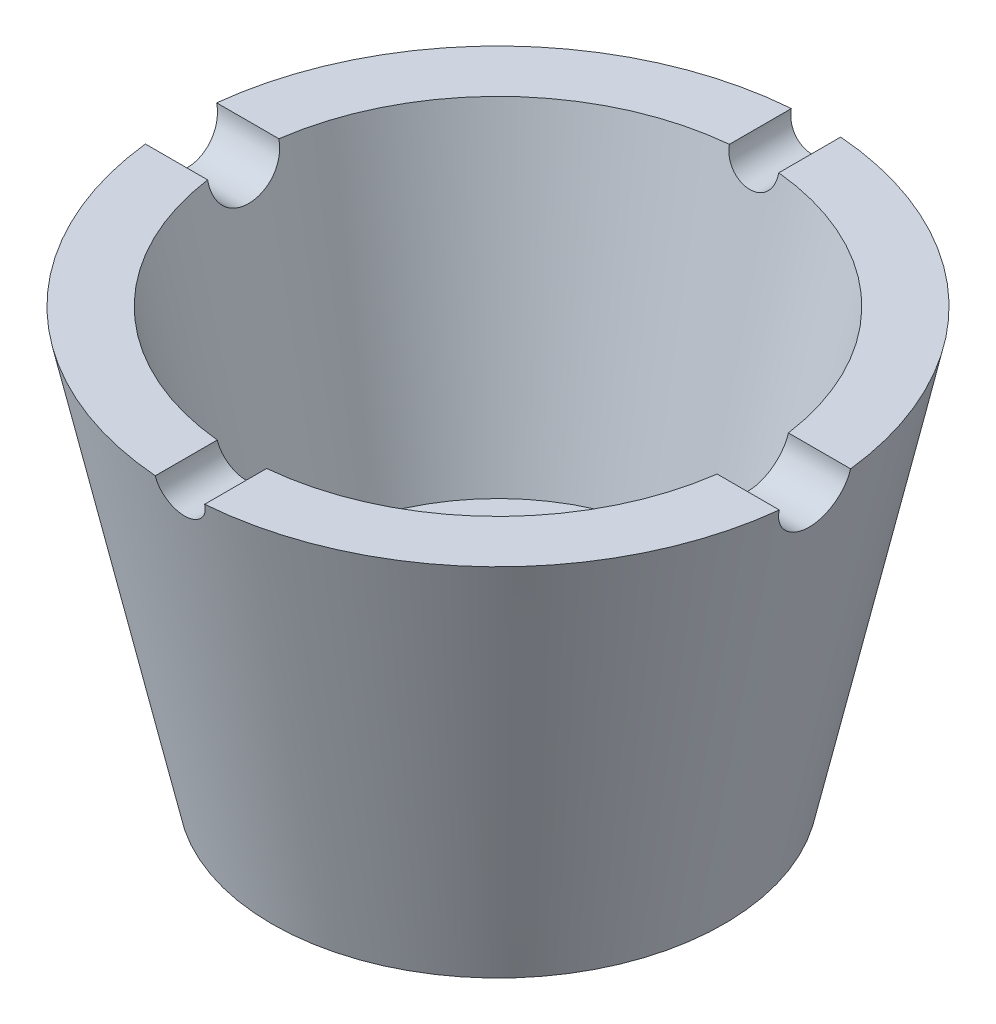
ISO-10303-21;
HEADER;
FILE_DESCRIPTION(('STEP AP214'),'2;1');
FILE_NAME('part.step','',(''),(''),'','','');
FILE_SCHEMA(('AUTOMOTIVE_DESIGN { 1 0 10303 214 1 1 1 1 }'));
ENDSEC;
DATA;
#1=APPLICATION_CONTEXT('core data for automotive mechanical design processes');
#2=APPLICATION_PROTOCOL_DEFINITION('international standard','automotive_design',2000,#1);
#3=PRODUCT_CONTEXT('',#1,'mechanical');
#4=PRODUCT('Part','Part','',(#3));
#5=PRODUCT_RELATED_PRODUCT_CATEGORY('part','',(#4));
#6=PRODUCT_DEFINITION_FORMATION('','',#4);
#7=PRODUCT_DEFINITION_CONTEXT('part definition',#1,'design');
#8=PRODUCT_DEFINITION('design','',#6,#7);
#9=PRODUCT_DEFINITION_SHAPE('','',#8);
#10=(LENGTH_UNIT() NAMED_UNIT(*) SI_UNIT(.MILLI.,.METRE.));
#11=(NAMED_UNIT(*) PLANE_ANGLE_UNIT() SI_UNIT($,.RADIAN.));
#12=(NAMED_UNIT(*) SI_UNIT($,.STERADIAN.) SOLID_ANGLE_UNIT());
#13=UNCERTAINTY_MEASURE_WITH_UNIT(LENGTH_MEASURE(1.E-05),#10,'distance_accuracy_value','');
#14=(GEOMETRIC_REPRESENTATION_CONTEXT(3) GLOBAL_UNCERTAINTY_ASSIGNED_CONTEXT((#13)) GLOBAL_UNIT_ASSIGNED_CONTEXT((#10,
#11,#12)) REPRESENTATION_CONTEXT('',''));
#15=CARTESIAN_POINT('',(0.,0.,0.));
#16=DIRECTION('',(0.,0.,1.));
#17=DIRECTION('',(1.,0.,0.));
#18=AXIS2_PLACEMENT_3D('',#15,#16,#17);
#19=CARTESIAN_POINT('',(31.7536642327049,40.8299646596772,0.));
#20=DIRECTION('',(0.,-1.,0.));
#21=DIRECTION('',(0.,0.,-1.));
#22=AXIS2_PLACEMENT_3D('',#19,#20,#21);
#23=PLANE('',#22);
#24=CARTESIAN_POINT('',(0.,40.8299646596772,0.));
#25=DIRECTION('',(0.,1.,0.));
#26=DIRECTION('',(0.,0.,1.));
#27=AXIS2_PLACEMENT_3D('',#24,#25,#26);
#28=CIRCLE('',#27,31.7536642327049);
#29=CARTESIAN_POINT('',(31.5548418955382,40.8299646596772,-3.54783668605957));
#30=VERTEX_POINT('',#29);
#31=CARTESIAN_POINT('',(2.45697094488806,40.8299646596772,-31.6584662606914));
#32=VERTEX_POINT('',#31);
#33=EDGE_CURVE('E117',#30,#32,#28,.T.);
#34=ORIENTED_EDGE('',*,*,#33,.T.);
#35=DIRECTION('',(0.,0.,1.));
#36=VECTOR('',#35,1.);
#37=CARTESIAN_POINT('',(2.45697094488806,40.8299646596772,-50.));
#38=LINE('',#37,#36);
#39=CARTESIAN_POINT('',(2.45697094488806,40.8299646596772,-25.4916282247166));
#40=VERTEX_POINT('',#39);
#41=EDGE_CURVE('E100',#32,#40,#38,.T.);
#42=ORIENTED_EDGE('',*,*,#41,.T.);
#43=CARTESIAN_POINT('',(0.,40.8299646596772,0.));
#44=DIRECTION('',(0.,1.,0.));
#45=DIRECTION('',(0.,0.,1.));
#46=AXIS2_PLACEMENT_3D('',#43,#44,#45);
#47=CIRCLE('',#46,25.6097601662178);
#48=CARTESIAN_POINT('',(25.3628206361249,40.8299646596772,-3.54783668605957));
#49=VERTEX_POINT('',#48);
#50=EDGE_CURVE('E133',#49,#40,#47,.T.);
#51=ORIENTED_EDGE('',*,*,#50,.F.);
#52=DIRECTION('',(1.,0.,0.));
#53=VECTOR('',#52,1.);
#54=CARTESIAN_POINT('',(-50.,40.8299646596772,-3.54783668605957));
#55=LINE('',#54,#53);
#56=EDGE_CURVE('E123',#49,#30,#55,.T.);
#57=ORIENTED_EDGE('',*,*,#56,.T.);
#58=EDGE_LOOP('',(#34,#42,#51,#57));
#59=FACE_BOUND('',#58,.T.);
#60=ADVANCED_FACE('F33',(#59),#23,.F.);
#61=CARTESIAN_POINT('',(2.45697094488806,40.8299646596772,25.4916282247166));
#62=VERTEX_POINT('',#61);
#63=CARTESIAN_POINT('',(25.3628206361249,40.8299646596772,3.54783668605957));
#64=VERTEX_POINT('',#63);
#65=EDGE_CURVE('E139',#62,#64,#47,.T.);
#66=ORIENTED_EDGE('',*,*,#65,.F.);
#67=CARTESIAN_POINT('',(2.45697094488806,40.8299646596772,31.6584662606914));
#68=VERTEX_POINT('',#67);
#69=EDGE_CURVE('E61',#62,#68,#38,.T.);
#70=ORIENTED_EDGE('',*,*,#69,.T.);
#71=CARTESIAN_POINT('',(31.5548418955382,40.8299646596772,3.54783668605957));
#72=VERTEX_POINT('',#71);
#73=EDGE_CURVE('E127',#68,#72,#28,.T.);
#74=ORIENTED_EDGE('',*,*,#73,.T.);
#75=DIRECTION('',(1.,0.,0.));
#76=VECTOR('',#75,1.);
#77=CARTESIAN_POINT('',(-50.,40.8299646596772,3.54783668605957));
#78=LINE('',#77,#76);
#79=EDGE_CURVE('E201',#64,#72,#78,.T.);
#80=ORIENTED_EDGE('',*,*,#79,.F.);
#81=EDGE_LOOP('',(#66,#70,#74,#80));
#82=FACE_BOUND('',#81,.T.);
#83=ADVANCED_FACE('F225',(#82),#23,.F.);
#84=CARTESIAN_POINT('',(-2.45697094488806,40.8299646596772,-25.4916282247166));
#85=VERTEX_POINT('',#84);
#86=CARTESIAN_POINT('',(-25.3628206361249,40.8299646596772,-3.54783668605957));
#87=VERTEX_POINT('',#86);
#88=EDGE_CURVE('E137',#85,#87,#47,.T.);
#89=ORIENTED_EDGE('',*,*,#88,.F.);
#90=DIRECTION('',(0.,0.,1.));
#91=VECTOR('',#90,1.);
#92=CARTESIAN_POINT('',(-2.45697094488806,40.8299646596772,-50.));
#93=LINE('',#92,#91);
#94=CARTESIAN_POINT('',(-2.45697094488806,40.8299646596772,-31.6584662606914));
#95=VERTEX_POINT('',#94);
#96=EDGE_CURVE('E53',#95,#85,#93,.T.);
#97=ORIENTED_EDGE('',*,*,#96,.F.);
#98=CARTESIAN_POINT('',(-31.5548418955382,40.8299646596772,-3.54783668605957));
#99=VERTEX_POINT('',#98);
#100=EDGE_CURVE('E119',#95,#99,#28,.T.);
#101=ORIENTED_EDGE('',*,*,#100,.T.);
#102=EDGE_CURVE('E199',#99,#87,#55,.T.);
#103=ORIENTED_EDGE('',*,*,#102,.T.);
#104=EDGE_LOOP('',(#89,#97,#101,#103));
#105=FACE_BOUND('',#104,.T.);
#106=ADVANCED_FACE('F197',(#105),#23,.F.);
#107=CARTESIAN_POINT('',(19.,10.8299646596772,0.));
#108=DIRECTION('',(0.,-1.,0.));
#109=DIRECTION('',(0.,0.,-1.));
#110=AXIS2_PLACEMENT_3D('',#107,#108,#109);
#111=PLANE('',#110);
#112=CARTESIAN_POINT('',(0.,10.8299646596772,0.));
#113=DIRECTION('',(0.,1.,0.));
#114=DIRECTION('',(0.,0.,1.));
#115=AXIS2_PLACEMENT_3D('',#112,#113,#114);
#116=CIRCLE('',#115,11.25);
#117=CARTESIAN_POINT('',(0.,10.8299646596772,11.25));
#118=VERTEX_POINT('',#117);
#119=EDGE_CURVE('E246',#118,#118,#116,.T.);
#120=ORIENTED_EDGE('',*,*,#119,.F.);
#121=EDGE_LOOP('',(#120));
#122=FACE_BOUND('',#121,.T.);
#123=CARTESIAN_POINT('',(0.,10.8299646596772,0.));
#124=DIRECTION('',(0.,1.,0.));
#125=DIRECTION('',(0.,0.,1.));
#126=AXIS2_PLACEMENT_3D('',#123,#124,#125);
#127=CIRCLE('',#126,19.);
#128=CARTESIAN_POINT('',(0.,10.8299646596772,19.));
#129=VERTEX_POINT('',#128);
#130=EDGE_CURVE('E144',#129,#129,#127,.T.);
#131=ORIENTED_EDGE('',*,*,#130,.T.);
#132=EDGE_LOOP('',(#131));
#133=FACE_BOUND('',#132,.T.);
#134=ADVANCED_FACE('F35',(#122,#133),#111,.F.);
#135=CARTESIAN_POINT('',(0.,29.136855034283,0.));
#136=DIRECTION('',(0.,1.,0.));
#137=DIRECTION('',(0.,0.,1.));
#138=AXIS2_PLACEMENT_3D('',#135,#136,#137);
#139=CYLINDRICAL_SURFACE('',#138,11.25);
#140=CARTESIAN_POINT('',(0.,-1.17003534032281,0.));
#141=DIRECTION('',(0.,1.,0.));
#142=DIRECTION('',(0.,0.,1.));
#143=AXIS2_PLACEMENT_3D('',#140,#141,#142);
#144=CIRCLE('',#143,11.25);
#145=CARTESIAN_POINT('',(0.,-1.17003534032281,11.25));
#146=VERTEX_POINT('',#145);
#147=EDGE_CURVE('E129',#146,#146,#144,.T.);
#148=ORIENTED_EDGE('',*,*,#147,.F.);
#149=EDGE_LOOP('',(#148));
#150=FACE_BOUND('',#149,.T.);
#151=ORIENTED_EDGE('',*,*,#119,.T.);
#152=EDGE_LOOP('',(#151));
#153=FACE_BOUND('',#152,.T.);
#154=ADVANCED_FACE('F238',(#150,#153),#139,.F.);
#155=CARTESIAN_POINT('',(11.25,-1.17003534032281,0.));
#156=DIRECTION('',(0.,1.,0.));
#157=DIRECTION('',(0.,0.,1.));
#158=AXIS2_PLACEMENT_3D('',#155,#156,#157);
#159=PLANE('',#158);
#160=CARTESIAN_POINT('',(0.,-1.17003534032281,0.));
#161=DIRECTION('',(0.,1.,0.));
#162=DIRECTION('',(0.,0.,1.));
#163=AXIS2_PLACEMENT_3D('',#160,#161,#162);
#164=CIRCLE('',#163,22.5);
#165=CARTESIAN_POINT('',(0.,-1.17003534032281,22.5));
#166=VERTEX_POINT('',#165);
#167=EDGE_CURVE('E124',#166,#166,#164,.T.);
#168=ORIENTED_EDGE('',*,*,#167,.F.);
#169=EDGE_LOOP('',(#168));
#170=FACE_BOUND('',#169,.T.);
#171=ORIENTED_EDGE('',*,*,#147,.T.);
#172=EDGE_LOOP('',(#171));
#173=FACE_BOUND('',#172,.T.);
#174=ADVANCED_FACE('F233',(#170,#173),#159,.F.);
#175=CARTESIAN_POINT('',(0.,-1.17003534032281,0.));
#176=DIRECTION('',(0.,1.,0.));
#177=DIRECTION('',(0.,0.,1.));
#178=AXIS2_PLACEMENT_3D('',#175,#176,#177);
#179=CONICAL_SURFACE('',#178,22.5,0.21686060319626);
#180=ORIENTED_EDGE('',*,*,#73,.F.);
#181=CARTESIAN_POINT('',(2.45697093674795,40.8301646596772,31.6585104588957));
#182=CARTESIAN_POINT('',(2.45697530247135,40.7606650400307,31.6431502035143));
#183=CARTESIAN_POINT('',(2.45403144753529,40.691147537341,31.62801758532));
#184=CARTESIAN_POINT('',(2.44224571226652,40.5524947761052,31.5982906073727));
#185=CARTESIAN_POINT('',(2.43340349154314,40.4833595398517,31.5836962787353));
#186=CARTESIAN_POINT('',(2.3980462905912,40.2772764166587,31.5408707090316));
#187=CARTESIAN_POINT('',(2.36270077553907,40.141538503742,31.5135720263775));
#188=CARTESIAN_POINT('',(2.26916204918159,39.8774545783167,31.4621095403373));
#189=CARTESIAN_POINT('',(2.21094645043471,39.7491159505361,31.43794883964));
#190=CARTESIAN_POINT('',(2.07313353670098,39.5038477314057,31.3931805330315));
#191=CARTESIAN_POINT('',(1.99354694383027,39.3869124588335,31.3725711538637));
#192=CARTESIAN_POINT('',(1.81650177737337,39.1697350428393,31.3353856949967));
#193=CARTESIAN_POINT('',(1.71933240364092,39.0692667260093,31.3187532121502));
#194=CARTESIAN_POINT('',(1.50903134169306,38.8860043873824,31.2891654959929));
#195=CARTESIAN_POINT('',(1.39589747759227,38.8032127787101,31.2762107646686));
#196=CARTESIAN_POINT('',(1.15875279484649,38.6590277461107,31.2540976843481));
#197=CARTESIAN_POINT('',(1.0349315186236,38.5973307419604,31.2448850818165));
#198=CARTESIAN_POINT('',(0.778529229482333,38.4955223779,31.22988657096));
#199=CARTESIAN_POINT('',(0.645949292568522,38.4554083720271,31.224100242583));
#200=CARTESIAN_POINT('',(0.376835736493202,38.398198373493,31.215897387854));
#201=CARTESIAN_POINT('',(0.240338348594673,38.3809353297819,31.2134564008187));
#202=CARTESIAN_POINT('',(-0.033646303625275,38.3694010029154,31.2118221451058));
#203=CARTESIAN_POINT('',(-0.171133573761065,38.3751298549198,31.2126288955202));
#204=CARTESIAN_POINT('',(-0.44286156356271,38.4093676925002,31.2174991904334));
#205=CARTESIAN_POINT('',(-0.577108978801101,38.4378246386141,31.2215552951006));
#206=CARTESIAN_POINT('',(-0.838878380341739,38.5165967703389,31.2329807695684));
#207=CARTESIAN_POINT('',(-0.966400435225855,38.5669117330044,31.240350105575));
#208=CARTESIAN_POINT('',(-1.21126759739643,38.6879538117074,31.2585040993462));
#209=CARTESIAN_POINT('',(-1.32860127722658,38.758703472634,31.2692925305648));
#210=CARTESIAN_POINT('',(-1.54966440120315,38.9184615327715,31.2943591543757));
#211=CARTESIAN_POINT('',(-1.653394306205,39.0074693131894,31.3086372287023));
#212=CARTESIAN_POINT('',(-1.84493720543074,39.2015902550399,31.3407801309198));
#213=CARTESIAN_POINT('',(-1.93266508528193,39.3067843481137,31.3586631310852));
#214=CARTESIAN_POINT('',(-2.08925706514733,39.5298548493036,31.3978771789992));
#215=CARTESIAN_POINT('',(-2.15811501268172,39.6477353763843,31.4192093477419));
#216=CARTESIAN_POINT('',(-2.27597489812293,39.8942527747503,31.4653494940886));
#217=CARTESIAN_POINT('',(-2.32471640167319,40.0230062147376,31.4901977871781));
#218=CARTESIAN_POINT('',(-2.39994111038558,40.2862061161032,31.5427121959118));
#219=CARTESIAN_POINT('',(-2.42645199714132,40.4206452777209,31.5703747589243));
#220=CARTESIAN_POINT('',(-2.44676456752571,40.6015632558213,31.6087838358102));
#221=CARTESIAN_POINT('',(-2.45059939803923,40.6472759304324,31.61858858828));
#222=CARTESIAN_POINT('',(-2.45570090217345,40.7387149143056,31.6383998381174));
#223=CARTESIAN_POINT('',(-2.45697216411627,40.7844410524433,31.6484059426115));
#224=CARTESIAN_POINT('',(-2.45697093674808,40.8301646596772,31.6585104588957));
#225=B_SPLINE_CURVE_WITH_KNOTS('',3,(#181,#182,#183,#184,#185,#186,#187,#188,#189,#190,#191,
#192,#193,#194,#195,#196,#197,#198,#199,#200,#201,#202,#203,#204,#205,#206,#207,#208,#209,#210,
#211,#212,#213,#214,#215,#216,#217,#218,#219,#220,#221,#222,#223,#224),.UNSPECIFIED.,.F.,.F.,(4,
2,2,2,2,2,2,2,2,2,2,2,2,2,2,2,2,2,2,2,2,4),(0.,0.213404193687361,0.426820703850684,
0.853312087552914,1.28022200659447,1.70691813806655,2.12714619587172,2.54743158421581,
2.96138522921945,3.37528811410063,3.78614815373715,4.19701060865551,4.60693501851001,
5.01685524735126,5.42722946574133,5.8375897782804,6.2500728940957,6.66269033910429,
7.08049370536031,7.49777604649007,7.63845305369234,7.77887805032776),.UNSPECIFIED.);
#226=CARTESIAN_POINT('',(-2.45697094488806,40.8299646596772,31.6584662606914));
#227=VERTEX_POINT('',#226);
#228=EDGE_CURVE('E120',#68,#227,#225,.T.);
#229=ORIENTED_EDGE('',*,*,#228,.T.);
#230=CARTESIAN_POINT('',(-31.5548418955382,40.8299646596772,3.54783668605957));
#231=VERTEX_POINT('',#230);
#232=EDGE_CURVE('E126',#231,#227,#28,.T.);
#233=ORIENTED_EDGE('',*,*,#232,.F.);
#234=CARTESIAN_POINT('',(-31.5548862388868,40.8301646596772,3.54783668042233));
#235=CARTESIAN_POINT('',(-31.5327836749577,40.7304987209449,3.54785096942798));
#236=CARTESIAN_POINT('',(-31.5111395268332,40.6307305549193,3.54364804212754));
#237=CARTESIAN_POINT('',(-31.4688982142408,40.43167617522,3.52682205236486));
#238=CARTESIAN_POINT('',(-31.4483011319261,40.3323899999146,3.51419833029765));
#239=CARTESIAN_POINT('',(-31.4082858280654,40.1349930645721,3.48054355440325));
#240=CARTESIAN_POINT('',(-31.3888677115219,40.0368824098535,3.45951175298587));
#241=CARTESIAN_POINT('',(-31.3513184288973,39.8425957378145,3.40915436407429));
#242=CARTESIAN_POINT('',(-31.3331872026069,39.7464196301342,3.37982916491975));
#243=CARTESIAN_POINT('',(-31.2808066078839,39.4616388572994,3.27952196490582));
#244=CARTESIAN_POINT('',(-31.2485790137489,39.2768248500516,3.19621569505338));
#245=CARTESIAN_POINT('',(-31.1899352222555,38.9235707215131,2.9989603966513));
#246=CARTESIAN_POINT('',(-31.1635159847572,38.7551220603623,2.8850274680825));
#247=CARTESIAN_POINT('',(-31.1167315427132,38.4421730299599,2.63162798741356));
#248=CARTESIAN_POINT('',(-31.0962767376732,38.2973343955685,2.49259633749417));
#249=CARTESIAN_POINT('',(-31.0605187512566,38.0328753991456,2.19170407934442));
#250=CARTESIAN_POINT('',(-31.0452164613122,37.9132594021978,2.02983952767959));
#251=CARTESIAN_POINT('',(-31.0194173675992,37.7041048430719,1.68983689323536));
#252=CARTESIAN_POINT('',(-31.0088698870959,37.6142519420288,1.51189593246153));
#253=CARTESIAN_POINT('',(-30.9918556363988,37.4655328967518,1.14334025649335));
#254=CARTESIAN_POINT('',(-30.9853884594563,37.406663663982,0.952726806661361));
#255=CARTESIAN_POINT('',(-30.9761730120704,37.3217518968893,0.564737478083111));
#256=CARTESIAN_POINT('',(-30.9734155198179,37.295627972942,0.367379623433253));
#257=CARTESIAN_POINT('',(-30.9714110204541,37.276703277859,-0.0289505726147485));
#258=CARTESIAN_POINT('',(-30.9721641004688,37.283903333764,-0.227922953960175));
#259=CARTESIAN_POINT('',(-30.977230777832,37.3314156976258,-0.621810236408191));
#260=CARTESIAN_POINT('',(-30.9815440641681,37.3717251132163,-0.816725490408184));
#261=CARTESIAN_POINT('',(-30.9939985302949,37.4842664735009,-1.19698052940302));
#262=CARTESIAN_POINT('',(-31.0021396657968,37.5564980488504,-1.38232042515859));
#263=CARTESIAN_POINT('',(-31.0226776919901,37.7307445801393,-1.73816750948667));
#264=CARTESIAN_POINT('',(-31.0350745358655,37.8327592084409,-1.90867486120251));
#265=CARTESIAN_POINT('',(-31.0646143239108,38.0635234225944,-2.23003960784053));
#266=CARTESIAN_POINT('',(-31.0817570182477,38.1922716010387,-2.38089803651481));
#267=CARTESIAN_POINT('',(-31.1212388017707,38.4727796043667,-2.65892073722594));
#268=CARTESIAN_POINT('',(-31.1435828522115,38.6245613511392,-2.78606217718962));
#269=CARTESIAN_POINT('',(-31.1937136831572,38.9465536860492,-3.01309106869169));
#270=CARTESIAN_POINT('',(-31.2215019397002,39.1167692663746,-3.11297111148115));
#271=CARTESIAN_POINT('',(-31.2826889798463,39.471853075557,-3.28356362132377));
#272=CARTESIAN_POINT('',(-31.3161278739624,39.656820679692,-3.3540541050579));
#273=CARTESIAN_POINT('',(-31.3880466078982,40.0348515044509,-3.46317000956134));
#274=CARTESIAN_POINT('',(-31.4265204523433,40.2279049138682,-3.50183293603879));
#275=CARTESIAN_POINT('',(-31.481233335464,40.4900292379814,-3.53217830963762));
#276=CARTESIAN_POINT('',(-31.4956559525823,40.5580604147469,-3.53806133804175));
#277=CARTESIAN_POINT('',(-31.5249431804149,40.6941224138694,-3.5458869583645));
#278=CARTESIAN_POINT('',(-31.539806924792,40.7621530044066,-3.54783681432116));
#279=CARTESIAN_POINT('',(-31.5548862388868,40.8301646596772,-3.54783668042233));
#280=B_SPLINE_CURVE_WITH_KNOTS('',3,(#234,#235,#236,#237,#238,#239,#240,#241,#242,#243,#244,
#245,#246,#247,#248,#249,#250,#251,#252,#253,#254,#255,#256,#257,#258,#259,#260,#261,#262,#263,
#264,#265,#266,#267,#268,#269,#270,#271,#272,#273,#274,#275,#276,#277,#278,#279),.UNSPECIFIED.,
.F.,.F.,(4,2,2,2,2,2,2,2,2,2,2,2,2,2,2,2,2,2,2,2,2,2,4),(0.,0.306173130445111,0.612370246398015,
0.918594593408126,1.22480460378844,1.83735667068734,2.44958735563007,3.05208117511146,
3.65467917804114,4.25069336483242,4.84664812805755,5.44111866825826,6.03560396221838,
6.63003732867583,7.22446381762412,7.81888376764239,8.4132724319109,9.00823038715152,
9.60334987171739,10.2028863247777,10.8017152664788,11.0110071479607,11.2199121404095),.UNSPECIFIED.);
#281=EDGE_CURVE('E151',#231,#99,#280,.T.);
#282=ORIENTED_EDGE('',*,*,#281,.T.);
#283=ORIENTED_EDGE('',*,*,#100,.F.);
#284=CARTESIAN_POINT('',(-2.45697093674795,40.8301646596772,-31.6585104588957));
#285=CARTESIAN_POINT('',(-2.45697530247135,40.7606650400307,-31.6431502035143));
#286=CARTESIAN_POINT('',(-2.45403144753529,40.691147537341,-31.62801758532));
#287=CARTESIAN_POINT('',(-2.44224571226652,40.5524947761052,-31.5982906073727));
#288=CARTESIAN_POINT('',(-2.43340349154314,40.4833595398517,-31.5836962787353));
#289=CARTESIAN_POINT('',(-2.3980462905912,40.2772764166587,-31.5408707090316));
#290=CARTESIAN_POINT('',(-2.36270077553907,40.141538503742,-31.5135720263775));
#291=CARTESIAN_POINT('',(-2.26916204918159,39.8774545783167,-31.4621095403373));
#292=CARTESIAN_POINT('',(-2.21094645043471,39.7491159505361,-31.43794883964));
#293=CARTESIAN_POINT('',(-2.07313353670098,39.5038477314057,-31.3931805330315));
#294=CARTESIAN_POINT('',(-1.99354694383027,39.3869124588335,-31.3725711538637));
#295=CARTESIAN_POINT('',(-1.81650177737337,39.1697350428393,-31.3353856949967));
#296=CARTESIAN_POINT('',(-1.71933240364092,39.0692667260093,-31.3187532121502));
#297=CARTESIAN_POINT('',(-1.50903134169306,38.8860043873824,-31.2891654959929));
#298=CARTESIAN_POINT('',(-1.39589747759227,38.8032127787101,-31.2762107646686));
#299=CARTESIAN_POINT('',(-1.15875279484649,38.6590277461107,-31.2540976843481));
#300=CARTESIAN_POINT('',(-1.0349315186236,38.5973307419604,-31.2448850818165));
#301=CARTESIAN_POINT('',(-0.778529229482333,38.4955223779,-31.22988657096));
#302=CARTESIAN_POINT('',(-0.645949292568522,38.4554083720271,-31.224100242583));
#303=CARTESIAN_POINT('',(-0.376835736493202,38.398198373493,-31.215897387854));
#304=CARTESIAN_POINT('',(-0.240338348594673,38.3809353297819,-31.2134564008187));
#305=CARTESIAN_POINT('',(0.033646303625275,38.3694010029154,-31.2118221451058));
#306=CARTESIAN_POINT('',(0.171133573761065,38.3751298549198,-31.2126288955202));
#307=CARTESIAN_POINT('',(0.44286156356271,38.4093676925002,-31.2174991904334));
#308=CARTESIAN_POINT('',(0.577108978801101,38.4378246386141,-31.2215552951006));
#309=CARTESIAN_POINT('',(0.838878380341739,38.5165967703389,-31.2329807695684));
#310=CARTESIAN_POINT('',(0.966400435225855,38.5669117330044,-31.240350105575));
#311=CARTESIAN_POINT('',(1.21126759739643,38.6879538117074,-31.2585040993462));
#312=CARTESIAN_POINT('',(1.32860127722658,38.758703472634,-31.2692925305648));
#313=CARTESIAN_POINT('',(1.54966440120315,38.9184615327715,-31.2943591543757));
#314=CARTESIAN_POINT('',(1.653394306205,39.0074693131894,-31.3086372287023));
#315=CARTESIAN_POINT('',(1.84493720543074,39.2015902550399,-31.3407801309198));
#316=CARTESIAN_POINT('',(1.93266508528193,39.3067843481137,-31.3586631310852));
#317=CARTESIAN_POINT('',(2.08925706514733,39.5298548493036,-31.3978771789992));
#318=CARTESIAN_POINT('',(2.15811501268172,39.6477353763843,-31.4192093477419));
#319=CARTESIAN_POINT('',(2.27597489812293,39.8942527747503,-31.4653494940886));
#320=CARTESIAN_POINT('',(2.32471640167319,40.0230062147376,-31.4901977871781));
#321=CARTESIAN_POINT('',(2.39994111038558,40.2862061161032,-31.5427121959118));
#322=CARTESIAN_POINT('',(2.42645199714132,40.4206452777209,-31.5703747589243));
#323=CARTESIAN_POINT('',(2.44676456752571,40.6015632558213,-31.6087838358102));
#324=CARTESIAN_POINT('',(2.45059939803923,40.6472759304324,-31.61858858828));
#325=CARTESIAN_POINT('',(2.45570090217345,40.7387149143056,-31.6383998381174));
#326=CARTESIAN_POINT('',(2.45697216411627,40.7844410524433,-31.6484059426115));
#327=CARTESIAN_POINT('',(2.45697093674808,40.8301646596772,-31.6585104588957));
#328=B_SPLINE_CURVE_WITH_KNOTS('',3,(#284,#285,#286,#287,#288,#289,#290,#291,#292,#293,#294,
#295,#296,#297,#298,#299,#300,#301,#302,#303,#304,#305,#306,#307,#308,#309,#310,#311,#312,#313,
#314,#315,#316,#317,#318,#319,#320,#321,#322,#323,#324,#325,#326,#327),.UNSPECIFIED.,.F.,.F.,(4,
2,2,2,2,2,2,2,2,2,2,2,2,2,2,2,2,2,2,2,2,4),(0.,0.213404193687361,0.426820703850684,
0.853312087552914,1.28022200659447,1.70691813806655,2.12714619587172,2.54743158421581,
2.96138522921945,3.37528811410063,3.78614815373715,4.19701060865551,4.60693501851001,
5.01685524735126,5.42722946574133,5.8375897782804,6.2500728940957,6.66269033910429,
7.08049370536031,7.49777604649007,7.63845305369234,7.77887805032776),.UNSPECIFIED.);
#329=EDGE_CURVE('E103',#95,#32,#328,.T.);
#330=ORIENTED_EDGE('',*,*,#329,.T.);
#331=ORIENTED_EDGE('',*,*,#33,.F.);
#332=CARTESIAN_POINT('',(31.5548862388868,40.8301646596772,-3.54783668042233));
#333=CARTESIAN_POINT('',(31.5327836749577,40.7304987209449,-3.54785096942798));
#334=CARTESIAN_POINT('',(31.5111395268332,40.6307305549193,-3.54364804212754));
#335=CARTESIAN_POINT('',(31.4688982142408,40.43167617522,-3.52682205236486));
#336=CARTESIAN_POINT('',(31.4483011319261,40.3323899999146,-3.51419833029765));
#337=CARTESIAN_POINT('',(31.4082858280654,40.1349930645721,-3.48054355440325));
#338=CARTESIAN_POINT('',(31.3888677115219,40.0368824098535,-3.45951175298587));
#339=CARTESIAN_POINT('',(31.3513184288973,39.8425957378145,-3.40915436407429));
#340=CARTESIAN_POINT('',(31.3331872026069,39.7464196301342,-3.37982916491975));
#341=CARTESIAN_POINT('',(31.2808066078839,39.4616388572994,-3.27952196490582));
#342=CARTESIAN_POINT('',(31.2485790137489,39.2768248500516,-3.19621569505338));
#343=CARTESIAN_POINT('',(31.1899352222555,38.9235707215131,-2.9989603966513));
#344=CARTESIAN_POINT('',(31.1635159847572,38.7551220603623,-2.8850274680825));
#345=CARTESIAN_POINT('',(31.1167315427132,38.4421730299599,-2.63162798741356));
#346=CARTESIAN_POINT('',(31.0962767376732,38.2973343955685,-2.49259633749417));
#347=CARTESIAN_POINT('',(31.0605187512566,38.0328753991456,-2.19170407934442));
#348=CARTESIAN_POINT('',(31.0452164613122,37.9132594021978,-2.02983952767959));
#349=CARTESIAN_POINT('',(31.0194173675992,37.7041048430719,-1.68983689323536));
#350=CARTESIAN_POINT('',(31.0088698870959,37.6142519420288,-1.51189593246153));
#351=CARTESIAN_POINT('',(30.9918556363988,37.4655328967518,-1.14334025649335));
#352=CARTESIAN_POINT('',(30.9853884594563,37.406663663982,-0.952726806661361));
#353=CARTESIAN_POINT('',(30.9761730120704,37.3217518968893,-0.564737478083111));
#354=CARTESIAN_POINT('',(30.9734155198179,37.295627972942,-0.367379623433253));
#355=CARTESIAN_POINT('',(30.9714110204541,37.276703277859,0.0289505726147485));
#356=CARTESIAN_POINT('',(30.9721641004688,37.283903333764,0.227922953960175));
#357=CARTESIAN_POINT('',(30.977230777832,37.3314156976258,0.621810236408191));
#358=CARTESIAN_POINT('',(30.9815440641681,37.3717251132163,0.816725490408184));
#359=CARTESIAN_POINT('',(30.9939985302949,37.4842664735009,1.19698052940302));
#360=CARTESIAN_POINT('',(31.0021396657968,37.5564980488504,1.38232042515859));
#361=CARTESIAN_POINT('',(31.0226776919901,37.7307445801393,1.73816750948667));
#362=CARTESIAN_POINT('',(31.0350745358655,37.8327592084409,1.90867486120251));
#363=CARTESIAN_POINT('',(31.0646143239108,38.0635234225944,2.23003960784053));
#364=CARTESIAN_POINT('',(31.0817570182477,38.1922716010387,2.38089803651481));
#365=CARTESIAN_POINT('',(31.1212388017707,38.4727796043667,2.65892073722594));
#366=CARTESIAN_POINT('',(31.1435828522115,38.6245613511392,2.78606217718962));
#367=CARTESIAN_POINT('',(31.1937136831572,38.9465536860492,3.01309106869169));
#368=CARTESIAN_POINT('',(31.2215019397002,39.1167692663746,3.11297111148115));
#369=CARTESIAN_POINT('',(31.2826889798463,39.471853075557,3.28356362132377));
#370=CARTESIAN_POINT('',(31.3161278739624,39.656820679692,3.3540541050579));
#371=CARTESIAN_POINT('',(31.3880466078982,40.0348515044509,3.46317000956134));
#372=CARTESIAN_POINT('',(31.4265204523433,40.2279049138682,3.50183293603879));
#373=CARTESIAN_POINT('',(31.481233335464,40.4900292379814,3.53217830963762));
#374=CARTESIAN_POINT('',(31.4956559525823,40.5580604147469,3.53806133804175));
#375=CARTESIAN_POINT('',(31.5249431804149,40.6941224138694,3.5458869583645));
#376=CARTESIAN_POINT('',(31.539806924792,40.7621530044066,3.54783681432116));
#377=CARTESIAN_POINT('',(31.5548862388868,40.8301646596772,3.54783668042233));
#378=B_SPLINE_CURVE_WITH_KNOTS('',3,(#332,#333,#334,#335,#336,#337,#338,#339,#340,#341,#342,
#343,#344,#345,#346,#347,#348,#349,#350,#351,#352,#353,#354,#355,#356,#357,#358,#359,#360,#361,
#362,#363,#364,#365,#366,#367,#368,#369,#370,#371,#372,#373,#374,#375,#376,#377),.UNSPECIFIED.,
.F.,.F.,(4,2,2,2,2,2,2,2,2,2,2,2,2,2,2,2,2,2,2,2,2,2,4),(0.,0.306173130445111,0.612370246398015,
0.918594593408126,1.22480460378844,1.83735667068734,2.44958735563007,3.05208117511146,
3.65467917804114,4.25069336483242,4.84664812805755,5.44111866825826,6.03560396221838,
6.63003732867583,7.22446381762412,7.81888376764239,8.4132724319109,9.00823038715152,
9.60334987171739,10.2028863247777,10.8017152664788,11.0110071479607,11.2199121404095),.UNSPECIFIED.);
#379=EDGE_CURVE('E148',#30,#72,#378,.T.);
#380=ORIENTED_EDGE('',*,*,#379,.T.);
#381=EDGE_LOOP('',(#180,#229,#233,#282,#283,#330,#331,#380));
#382=FACE_BOUND('',#381,.T.);
#383=ORIENTED_EDGE('',*,*,#167,.T.);
#384=EDGE_LOOP('',(#383));
#385=FACE_BOUND('',#384,.T.);
#386=ADVANCED_FACE('F114',(#382,#385),#179,.T.);
#387=ORIENTED_EDGE('',*,*,#232,.T.);
#388=CARTESIAN_POINT('',(-2.45697094488806,40.8299646596772,25.4916282247166));
#389=VERTEX_POINT('',#388);
#390=EDGE_CURVE('E108',#389,#227,#93,.T.);
#391=ORIENTED_EDGE('',*,*,#390,.F.);
#392=CARTESIAN_POINT('',(-25.3628206361249,40.8299646596772,3.54783668605957));
#393=VERTEX_POINT('',#392);
#394=EDGE_CURVE('E138',#393,#389,#47,.T.);
#395=ORIENTED_EDGE('',*,*,#394,.F.);
#396=EDGE_CURVE('E202',#231,#393,#78,.T.);
#397=ORIENTED_EDGE('',*,*,#396,.F.);
#398=EDGE_LOOP('',(#387,#391,#395,#397));
#399=FACE_BOUND('',#398,.T.);
#400=ADVANCED_FACE('F218',(#399),#23,.F.);
#401=CARTESIAN_POINT('',(0.,40.8299646596772,0.));
#402=DIRECTION('',(0.,1.,0.));
#403=DIRECTION('',(0.,0.,1.));
#404=AXIS2_PLACEMENT_3D('',#401,#402,#403);
#405=CONICAL_SURFACE('',#404,25.6097601662178,0.21686060319626);
#406=ORIENTED_EDGE('',*,*,#130,.F.);
#407=EDGE_LOOP('',(#406));
#408=FACE_BOUND('',#407,.T.);
#409=ORIENTED_EDGE('',*,*,#394,.T.);
#410=CARTESIAN_POINT('',(-2.45697093674795,40.8301646596772,25.4916724947726));
#411=CARTESIAN_POINT('',(-2.45697532455304,40.7609060124925,25.4763402701913));
#412=CARTESIAN_POINT('',(-2.45405179790056,40.6916175057774,25.4612870149993));
#413=CARTESIAN_POINT('',(-2.44234178394226,40.5533964140691,25.4318200240179));
#414=CARTESIAN_POINT('',(-2.4335548908728,40.4844638540414,25.4174063325619));
#415=CARTESIAN_POINT('',(-2.39840801061189,40.2789488282787,25.3752728324824));
#416=CARTESIAN_POINT('',(-2.36326184419294,40.1435357372996,25.3486355552371));
#417=CARTESIAN_POINT('',(-2.27020478604348,39.8799914455004,25.2988400027507));
#418=CARTESIAN_POINT('',(-2.21227030031914,39.7518679498747,25.2756853677373));
#419=CARTESIAN_POINT('',(-2.07509062851368,39.5069447162719,25.233171942279));
#420=CARTESIAN_POINT('',(-1.9958564482768,39.3901391724408,25.2138112003851));
#421=CARTESIAN_POINT('',(-1.81962431587403,39.1731894146579,25.1792124338763));
#422=CARTESIAN_POINT('',(-1.72292355900084,39.0728131966808,25.1639146677918));
#423=CARTESIAN_POINT('',(-1.51364161679724,38.8896209221197,25.1369343236342));
#424=CARTESIAN_POINT('',(-1.40105795472612,38.8068076093029,25.1252523103018));
#425=CARTESIAN_POINT('',(-1.16481003030432,38.6622805625939,25.1054278139512));
#426=CARTESIAN_POINT('',(-1.04130734210693,38.6003085615664,25.0972416382993));
#427=CARTESIAN_POINT('',(-0.785536428594297,38.4978813160733,25.0839698514433));
#428=CARTESIAN_POINT('',(-0.65326916473421,38.4574237159039,25.0788839007734));
#429=CARTESIAN_POINT('',(-0.384377293672605,38.3993696362804,25.0716502426519));
#430=CARTESIAN_POINT('',(-0.247775742022322,38.3816679932638,25.0694890165221));
#431=CARTESIAN_POINT('',(0.0264848009431495,38.3693046940271,25.0679754306353));
#432=CARTESIAN_POINT('',(0.164143809937404,38.3746434238472,25.0686231179416));
#433=CARTESIAN_POINT('',(0.436462409817716,38.408186646625,25.0727516913285));
#434=CARTESIAN_POINT('',(0.571124875130362,38.4363681620768,25.0762297303788));
#435=CARTESIAN_POINT('',(0.833772249945887,38.5147302021402,25.0861462132392));
#436=CARTESIAN_POINT('',(0.961757236245307,38.5649104736855,25.0925846229943));
#437=CARTESIAN_POINT('',(1.2074855937212,38.6858000436462,25.1086274018266));
#438=CARTESIAN_POINT('',(1.32522450978191,38.7565182147975,25.1182331394889));
#439=CARTESIAN_POINT('',(1.54709091226071,38.9163534159295,25.1408275642616));
#440=CARTESIAN_POINT('',(1.65121900909402,39.0054696203364,25.1538160995829));
#441=CARTESIAN_POINT('',(1.84327486683133,39.1997039047977,25.1833829354696));
#442=CARTESIAN_POINT('',(1.9311569630971,39.3048656177113,25.199971078084));
#443=CARTESIAN_POINT('',(2.08805015966723,39.5279098323698,25.2367675888101));
#444=CARTESIAN_POINT('',(2.15705564376022,39.6457961054371,25.2569770313856));
#445=CARTESIAN_POINT('',(2.27502635611713,39.8919937095146,25.3010887455838));
#446=CARTESIAN_POINT('',(2.3237882794458,40.020395991668,25.3250253096444));
#447=CARTESIAN_POINT('',(2.39915708604243,40.282841741676,25.3760790570962));
#448=CARTESIAN_POINT('',(2.42579074108922,40.416878186094,25.4031923516647));
#449=CARTESIAN_POINT('',(2.44644968663295,40.5980710288987,25.4413129054261));
#450=CARTESIAN_POINT('',(2.45040326472993,40.644487787206,25.4512064678601));
#451=CARTESIAN_POINT('',(2.45566210820345,40.7373273801059,25.4712495531084));
#452=CARTESIAN_POINT('',(2.4569721841769,40.7837500496386,25.4813985768862));
#453=CARTESIAN_POINT('',(2.45697093674817,40.8301646596772,25.4916724947726));
#454=B_SPLINE_CURVE_WITH_KNOTS('',3,(#410,#411,#412,#413,#414,#415,#416,#417,#418,#419,#420,
#421,#422,#423,#424,#425,#426,#427,#428,#429,#430,#431,#432,#433,#434,#435,#436,#437,#438,#439,
#440,#441,#442,#443,#444,#445,#446,#447,#448,#449,#450,#451,#452,#453),.UNSPECIFIED.,.F.,.F.,(4,
2,2,2,2,2,2,2,2,2,2,2,2,2,2,2,2,2,2,2,2,4),(0.,0.21268141679044,0.425377553339159,
0.850426134420099,1.27591595483275,1.70118634001871,2.11980573885485,2.53849048846147,
2.95177721781645,3.36501868531779,3.77634346593655,4.18767513830649,4.59859356579824,
5.00950726634545,5.42059875362668,5.83167179803162,6.24388328796062,6.65621728690341,
7.07259761620145,7.48847345316803,7.63129077141537,7.77384795807237),.UNSPECIFIED.);
#455=EDGE_CURVE('E11',#389,#62,#454,.T.);
#456=ORIENTED_EDGE('',*,*,#455,.T.);
#457=ORIENTED_EDGE('',*,*,#65,.T.);
#458=CARTESIAN_POINT('',(25.3628651310103,40.8301646596772,3.54783668042233));
#459=CARTESIAN_POINT('',(25.3408121741351,40.7310664289931,3.54785108473833));
#460=CARTESIAN_POINT('',(25.319322597333,40.6318413308808,3.54369566964763));
#461=CARTESIAN_POINT('',(25.2775979920015,40.4338186720118,3.52704860382946));
#462=CARTESIAN_POINT('',(25.2573630797978,40.3350211516854,3.51455618139925));
#463=CARTESIAN_POINT('',(25.2182788849083,40.1385493115857,3.48123778842773));
#464=CARTESIAN_POINT('',(25.1994296616862,40.0408750401657,3.46041146050326));
#465=CARTESIAN_POINT('',(25.1632132808635,39.8474045661702,3.41053009772678));
#466=CARTESIAN_POINT('',(25.145846046085,39.7516082659955,3.38147549172224));
#467=CARTESIAN_POINT('',(25.0960278821421,39.4678701156239,3.28206276715509));
#468=CARTESIAN_POINT('',(25.0658717976892,39.2836362261729,3.19946541439229));
#469=CARTESIAN_POINT('',(25.0118887409385,38.9313349433774,3.00382757434918));
#470=CARTESIAN_POINT('',(24.9880584101682,38.7632590018031,2.89080330580446));
#471=CARTESIAN_POINT('',(24.9466363764244,38.450855140555,2.63941542189917));
#472=CARTESIAN_POINT('',(24.9289506447002,38.3061892360906,2.50148781700006));
#473=CARTESIAN_POINT('',(24.8986235118429,38.0418060296948,2.20297147376191));
#474=CARTESIAN_POINT('',(24.8859831288278,37.9220937655699,2.04237817047529));
#475=CARTESIAN_POINT('',(24.8650149470435,37.7120400649304,1.70440330634155));
#476=CARTESIAN_POINT('',(24.8566562712268,37.6214901405482,1.52715317667813));
#477=CARTESIAN_POINT('',(24.8433556267177,37.471234613963,1.15992791764457));
#478=CARTESIAN_POINT('',(24.8384133652684,37.4115263690082,0.969953880132854));
#479=CARTESIAN_POINT('',(24.8313714065558,37.3246404401191,0.582493649824804));
#480=CARTESIAN_POINT('',(24.8292740390768,37.2974894205531,0.385001436019658));
#481=CARTESIAN_POINT('',(24.8276512772954,37.2765898371471,-0.0117595471185845));
#482=CARTESIAN_POINT('',(24.8281259749081,37.2828424670154,-0.211028379686646));
#483=CARTESIAN_POINT('',(24.8317145408034,37.328597910032,-0.605907528970524));
#484=CARTESIAN_POINT('',(24.8348312684728,37.3681367474866,-0.80151364712398));
#485=CARTESIAN_POINT('',(24.8441058217178,37.4793658195094,-1.18328416312705));
#486=CARTESIAN_POINT('',(24.8502636184446,37.5510557490781,-1.3694486505255));
#487=CARTESIAN_POINT('',(24.8662756777951,37.7244471373199,-1.72694921415181));
#488=CARTESIAN_POINT('',(24.8761281243047,37.8261338457724,-1.898292524923));
#489=CARTESIAN_POINT('',(24.9003236683134,38.056516065931,-2.22137047709701));
#490=CARTESIAN_POINT('',(24.9146664880033,38.1852099066045,-2.37310633074866));
#491=CARTESIAN_POINT('',(24.9485830128798,38.4655241691528,-2.6524825606349));
#492=CARTESIAN_POINT('',(24.9681483576623,38.6171077812945,-2.78016089656228));
#493=CARTESIAN_POINT('',(25.0130920630181,38.9388377986354,-3.00826704794036));
#494=CARTESIAN_POINT('',(25.0384717234447,39.1089883502141,-3.10868875889247));
#495=CARTESIAN_POINT('',(25.0953377806095,39.4632786550583,-3.27996701784323));
#496=CARTESIAN_POINT('',(25.1268438125374,39.6474621982264,-3.35072613166117));
#497=CARTESIAN_POINT('',(25.1956635069628,40.0238725902331,-3.4605933115269));
#498=CARTESIAN_POINT('',(25.2329706161066,40.2160901861706,-3.49973678773905));
#499=CARTESIAN_POINT('',(25.2871730501454,40.4794653698829,-3.53118842233248));
#500=CARTESIAN_POINT('',(25.301906131022,40.5496212959149,-3.537444473303));
#501=CARTESIAN_POINT('',(25.3319541939953,40.6899175340767,-3.54576472230611));
#502=CARTESIAN_POINT('',(25.3472680178977,40.7600576228477,-3.54783685832474));
#503=CARTESIAN_POINT('',(25.3628651310103,40.8301646596772,-3.54783668042233));
#504=B_SPLINE_CURVE_WITH_KNOTS('',3,(#458,#459,#460,#461,#462,#463,#464,#465,#466,#467,#468,
#469,#470,#471,#472,#473,#474,#475,#476,#477,#478,#479,#480,#481,#482,#483,#484,#485,#486,#487,
#488,#489,#490,#491,#492,#493,#494,#495,#496,#497,#498,#499,#500,#501,#502,#503),.UNSPECIFIED.,
.F.,.F.,(4,2,2,2,2,2,2,2,2,2,2,2,2,2,2,2,2,2,2,2,2,2,4),(0.,0.304480520786209,0.608989229270657,
0.913510997412546,1.21801689718418,1.8272037780356,2.43606657922818,3.03515295799438,
3.63436016740204,4.22918317865419,4.82395521244899,5.41921403257527,6.01449412493333,
6.61041929413513,7.20633881024648,7.80196578382223,8.39755591458295,8.99219826282889,
9.58697367977589,10.1836877596691,10.7797325771165,10.9955155440201,11.2108887277897),.UNSPECIFIED.);
#505=EDGE_CURVE('E185',#64,#49,#504,.T.);
#506=ORIENTED_EDGE('',*,*,#505,.T.);
#507=ORIENTED_EDGE('',*,*,#50,.T.);
#508=CARTESIAN_POINT('',(2.45697093674795,40.8301646596772,-25.4916724947726));
#509=CARTESIAN_POINT('',(2.45697532455304,40.7609060124925,-25.4763402701913));
#510=CARTESIAN_POINT('',(2.45405179790056,40.6916175057774,-25.4612870149993));
#511=CARTESIAN_POINT('',(2.44234178394226,40.5533964140691,-25.4318200240179));
#512=CARTESIAN_POINT('',(2.4335548908728,40.4844638540414,-25.4174063325619));
#513=CARTESIAN_POINT('',(2.39840801061189,40.2789488282787,-25.3752728324824));
#514=CARTESIAN_POINT('',(2.36326184419294,40.1435357372996,-25.3486355552371));
#515=CARTESIAN_POINT('',(2.27020478604348,39.8799914455004,-25.2988400027507));
#516=CARTESIAN_POINT('',(2.21227030031914,39.7518679498747,-25.2756853677373));
#517=CARTESIAN_POINT('',(2.07509062851368,39.5069447162719,-25.233171942279));
#518=CARTESIAN_POINT('',(1.9958564482768,39.3901391724408,-25.2138112003851));
#519=CARTESIAN_POINT('',(1.81962431587403,39.1731894146579,-25.1792124338763));
#520=CARTESIAN_POINT('',(1.72292355900084,39.0728131966808,-25.1639146677918));
#521=CARTESIAN_POINT('',(1.51364161679724,38.8896209221197,-25.1369343236342));
#522=CARTESIAN_POINT('',(1.40105795472612,38.8068076093029,-25.1252523103018));
#523=CARTESIAN_POINT('',(1.16481003030432,38.6622805625939,-25.1054278139512));
#524=CARTESIAN_POINT('',(1.04130734210693,38.6003085615664,-25.0972416382993));
#525=CARTESIAN_POINT('',(0.785536428594297,38.4978813160733,-25.0839698514433));
#526=CARTESIAN_POINT('',(0.65326916473421,38.4574237159039,-25.0788839007734));
#527=CARTESIAN_POINT('',(0.384377293672605,38.3993696362804,-25.0716502426519));
#528=CARTESIAN_POINT('',(0.247775742022322,38.3816679932638,-25.0694890165221));
#529=CARTESIAN_POINT('',(-0.0264848009431495,38.3693046940271,-25.0679754306353));
#530=CARTESIAN_POINT('',(-0.164143809937404,38.3746434238472,-25.0686231179416));
#531=CARTESIAN_POINT('',(-0.436462409817716,38.408186646625,-25.0727516913285));
#532=CARTESIAN_POINT('',(-0.571124875130362,38.4363681620768,-25.0762297303788));
#533=CARTESIAN_POINT('',(-0.833772249945887,38.5147302021402,-25.0861462132392));
#534=CARTESIAN_POINT('',(-0.961757236245307,38.5649104736855,-25.0925846229943));
#535=CARTESIAN_POINT('',(-1.2074855937212,38.6858000436462,-25.1086274018266));
#536=CARTESIAN_POINT('',(-1.32522450978191,38.7565182147975,-25.1182331394889));
#537=CARTESIAN_POINT('',(-1.54709091226071,38.9163534159295,-25.1408275642616));
#538=CARTESIAN_POINT('',(-1.65121900909402,39.0054696203364,-25.1538160995829));
#539=CARTESIAN_POINT('',(-1.84327486683133,39.1997039047977,-25.1833829354696));
#540=CARTESIAN_POINT('',(-1.9311569630971,39.3048656177113,-25.199971078084));
#541=CARTESIAN_POINT('',(-2.08805015966723,39.5279098323698,-25.2367675888101));
#542=CARTESIAN_POINT('',(-2.15705564376022,39.6457961054371,-25.2569770313856));
#543=CARTESIAN_POINT('',(-2.27502635611713,39.8919937095146,-25.3010887455838));
#544=CARTESIAN_POINT('',(-2.3237882794458,40.020395991668,-25.3250253096444));
#545=CARTESIAN_POINT('',(-2.39915708604243,40.282841741676,-25.3760790570962));
#546=CARTESIAN_POINT('',(-2.42579074108922,40.416878186094,-25.4031923516647));
#547=CARTESIAN_POINT('',(-2.44644968663295,40.5980710288987,-25.4413129054261));
#548=CARTESIAN_POINT('',(-2.45040326472993,40.644487787206,-25.4512064678601));
#549=CARTESIAN_POINT('',(-2.45566210820345,40.7373273801059,-25.4712495531084));
#550=CARTESIAN_POINT('',(-2.4569721841769,40.7837500496386,-25.4813985768862));
#551=CARTESIAN_POINT('',(-2.45697093674817,40.8301646596772,-25.4916724947726));
#552=B_SPLINE_CURVE_WITH_KNOTS('',3,(#508,#509,#510,#511,#512,#513,#514,#515,#516,#517,#518,
#519,#520,#521,#522,#523,#524,#525,#526,#527,#528,#529,#530,#531,#532,#533,#534,#535,#536,#537,
#538,#539,#540,#541,#542,#543,#544,#545,#546,#547,#548,#549,#550,#551),.UNSPECIFIED.,.F.,.F.,(4,
2,2,2,2,2,2,2,2,2,2,2,2,2,2,2,2,2,2,2,2,4),(0.,0.21268141679044,0.425377553339159,
0.850426134420099,1.27591595483275,1.70118634001871,2.11980573885485,2.53849048846147,
2.95177721781645,3.36501868531779,3.77634346593655,4.18767513830649,4.59859356579824,
5.00950726634545,5.42059875362668,5.83167179803162,6.24388328796062,6.65621728690341,
7.07259761620145,7.48847345316803,7.63129077141537,7.77384795807237),.UNSPECIFIED.);
#553=EDGE_CURVE('E46',#40,#85,#552,.T.);
#554=ORIENTED_EDGE('',*,*,#553,.T.);
#555=ORIENTED_EDGE('',*,*,#88,.T.);
#556=CARTESIAN_POINT('',(-25.3628651310103,40.8301646596772,-3.54783668042233));
#557=CARTESIAN_POINT('',(-25.3408121741351,40.7310664289931,-3.54785108473833));
#558=CARTESIAN_POINT('',(-25.319322597333,40.6318413308808,-3.54369566964763));
#559=CARTESIAN_POINT('',(-25.2775979920015,40.4338186720118,-3.52704860382946));
#560=CARTESIAN_POINT('',(-25.2573630797978,40.3350211516854,-3.51455618139925));
#561=CARTESIAN_POINT('',(-25.2182788849083,40.1385493115857,-3.48123778842773));
#562=CARTESIAN_POINT('',(-25.1994296616862,40.0408750401657,-3.46041146050326));
#563=CARTESIAN_POINT('',(-25.1632132808635,39.8474045661702,-3.41053009772678));
#564=CARTESIAN_POINT('',(-25.145846046085,39.7516082659955,-3.38147549172224));
#565=CARTESIAN_POINT('',(-25.0960278821421,39.4678701156239,-3.28206276715509));
#566=CARTESIAN_POINT('',(-25.0658717976892,39.2836362261729,-3.19946541439229));
#567=CARTESIAN_POINT('',(-25.0118887409385,38.9313349433774,-3.00382757434918));
#568=CARTESIAN_POINT('',(-24.9880584101682,38.7632590018031,-2.89080330580446));
#569=CARTESIAN_POINT('',(-24.9466363764244,38.450855140555,-2.63941542189917));
#570=CARTESIAN_POINT('',(-24.9289506447002,38.3061892360906,-2.50148781700006));
#571=CARTESIAN_POINT('',(-24.8986235118429,38.0418060296948,-2.20297147376191));
#572=CARTESIAN_POINT('',(-24.8859831288278,37.9220937655699,-2.04237817047529));
#573=CARTESIAN_POINT('',(-24.8650149470435,37.7120400649304,-1.70440330634155));
#574=CARTESIAN_POINT('',(-24.8566562712268,37.6214901405482,-1.52715317667813));
#575=CARTESIAN_POINT('',(-24.8433556267177,37.471234613963,-1.15992791764457));
#576=CARTESIAN_POINT('',(-24.8384133652684,37.4115263690082,-0.969953880132854));
#577=CARTESIAN_POINT('',(-24.8313714065558,37.3246404401191,-0.582493649824804));
#578=CARTESIAN_POINT('',(-24.8292740390768,37.2974894205531,-0.385001436019658));
#579=CARTESIAN_POINT('',(-24.8276512772954,37.2765898371471,0.0117595471185845));
#580=CARTESIAN_POINT('',(-24.8281259749081,37.2828424670154,0.211028379686646));
#581=CARTESIAN_POINT('',(-24.8317145408034,37.328597910032,0.605907528970524));
#582=CARTESIAN_POINT('',(-24.8348312684728,37.3681367474866,0.80151364712398));
#583=CARTESIAN_POINT('',(-24.8441058217178,37.4793658195094,1.18328416312705));
#584=CARTESIAN_POINT('',(-24.8502636184446,37.5510557490781,1.3694486505255));
#585=CARTESIAN_POINT('',(-24.8662756777951,37.7244471373199,1.72694921415181));
#586=CARTESIAN_POINT('',(-24.8761281243047,37.8261338457724,1.898292524923));
#587=CARTESIAN_POINT('',(-24.9003236683134,38.056516065931,2.22137047709701));
#588=CARTESIAN_POINT('',(-24.9146664880033,38.1852099066045,2.37310633074866));
#589=CARTESIAN_POINT('',(-24.9485830128798,38.4655241691528,2.6524825606349));
#590=CARTESIAN_POINT('',(-24.9681483576623,38.6171077812945,2.78016089656228));
#591=CARTESIAN_POINT('',(-25.0130920630181,38.9388377986354,3.00826704794036));
#592=CARTESIAN_POINT('',(-25.0384717234447,39.1089883502141,3.10868875889247));
#593=CARTESIAN_POINT('',(-25.0953377806095,39.4632786550583,3.27996701784323));
#594=CARTESIAN_POINT('',(-25.1268438125374,39.6474621982264,3.35072613166117));
#595=CARTESIAN_POINT('',(-25.1956635069628,40.0238725902331,3.4605933115269));
#596=CARTESIAN_POINT('',(-25.2329706161066,40.2160901861706,3.49973678773905));
#597=CARTESIAN_POINT('',(-25.2871730501454,40.4794653698829,3.53118842233248));
#598=CARTESIAN_POINT('',(-25.301906131022,40.5496212959149,3.537444473303));
#599=CARTESIAN_POINT('',(-25.3319541939953,40.6899175340767,3.54576472230611));
#600=CARTESIAN_POINT('',(-25.3472680178977,40.7600576228477,3.54783685832474));
#601=CARTESIAN_POINT('',(-25.3628651310103,40.8301646596772,3.54783668042233));
#602=B_SPLINE_CURVE_WITH_KNOTS('',3,(#556,#557,#558,#559,#560,#561,#562,#563,#564,#565,#566,
#567,#568,#569,#570,#571,#572,#573,#574,#575,#576,#577,#578,#579,#580,#581,#582,#583,#584,#585,
#586,#587,#588,#589,#590,#591,#592,#593,#594,#595,#596,#597,#598,#599,#600,#601),.UNSPECIFIED.,
.F.,.F.,(4,2,2,2,2,2,2,2,2,2,2,2,2,2,2,2,2,2,2,2,2,2,4),(0.,0.304480520786209,0.608989229270657,
0.913510997412546,1.21801689718418,1.8272037780356,2.43606657922818,3.03515295799438,
3.63436016740204,4.22918317865419,4.82395521244899,5.41921403257527,6.01449412493333,
6.61041929413513,7.20633881024648,7.80196578382223,8.39755591458295,8.99219826282889,
9.58697367977589,10.1836877596691,10.7797325771165,10.9955155440201,11.2108887277897),.UNSPECIFIED.);
#603=EDGE_CURVE('E178',#87,#393,#602,.T.);
#604=ORIENTED_EDGE('',*,*,#603,.T.);
#605=EDGE_LOOP('',(#409,#456,#457,#506,#507,#554,#555,#604));
#606=FACE_BOUND('',#605,.T.);
#607=ADVANCED_FACE('F173',(#408,#606),#405,.F.);
#608=CARTESIAN_POINT('',(-50.,40.8299646596772,0.));
#609=DIRECTION('',(1.,0.,0.));
#610=DIRECTION('',(0.,0.,-1.));
#611=AXIS2_PLACEMENT_3D('',#608,#609,#610);
#612=CYLINDRICAL_SURFACE('',#611,3.54783668605957);
#613=ORIENTED_EDGE('',*,*,#396,.T.);
#614=ORIENTED_EDGE('',*,*,#603,.F.);
#615=ORIENTED_EDGE('',*,*,#102,.F.);
#616=ORIENTED_EDGE('',*,*,#281,.F.);
#617=EDGE_LOOP('',(#613,#614,#615,#616));
#618=FACE_BOUND('',#617,.T.);
#619=ADVANCED_FACE('F169',(#618),#612,.F.);
#620=ORIENTED_EDGE('',*,*,#56,.F.);
#621=ORIENTED_EDGE('',*,*,#505,.F.);
#622=ORIENTED_EDGE('',*,*,#79,.T.);
#623=ORIENTED_EDGE('',*,*,#379,.F.);
#624=EDGE_LOOP('',(#620,#621,#622,#623));
#625=FACE_BOUND('',#624,.T.);
#626=ADVANCED_FACE('F166',(#625),#612,.F.);
#627=CARTESIAN_POINT('',(0.,40.8299646596772,-50.));
#628=DIRECTION('',(0.,0.,1.));
#629=DIRECTION('',(1.,0.,0.));
#630=AXIS2_PLACEMENT_3D('',#627,#628,#629);
#631=CYLINDRICAL_SURFACE('',#630,2.45697094488806);
#632=ORIENTED_EDGE('',*,*,#96,.T.);
#633=ORIENTED_EDGE('',*,*,#553,.F.);
#634=ORIENTED_EDGE('',*,*,#41,.F.);
#635=ORIENTED_EDGE('',*,*,#329,.F.);
#636=EDGE_LOOP('',(#632,#633,#634,#635));
#637=FACE_BOUND('',#636,.T.);
#638=ADVANCED_FACE('F102',(#637),#631,.F.);
#639=ORIENTED_EDGE('',*,*,#69,.F.);
#640=ORIENTED_EDGE('',*,*,#455,.F.);
#641=ORIENTED_EDGE('',*,*,#390,.T.);
#642=ORIENTED_EDGE('',*,*,#228,.F.);
#643=EDGE_LOOP('',(#639,#640,#641,#642));
#644=FACE_BOUND('',#643,.T.);
#645=ADVANCED_FACE('F171',(#644),#631,.F.);
#646=CLOSED_SHELL('',(#60,#83,#106,#134,#154,#174,#386,#400,#607,#619,#626,#638,#645));
#647=MANIFOLD_SOLID_BREP('B2',#646);
#648=ADVANCED_BREP_SHAPE_REPRESENTATION('',(#18,#647),#14);
#649=SHAPE_DEFINITION_REPRESENTATION(#9,#648);
ENDSEC;
END-ISO-10303-21;
